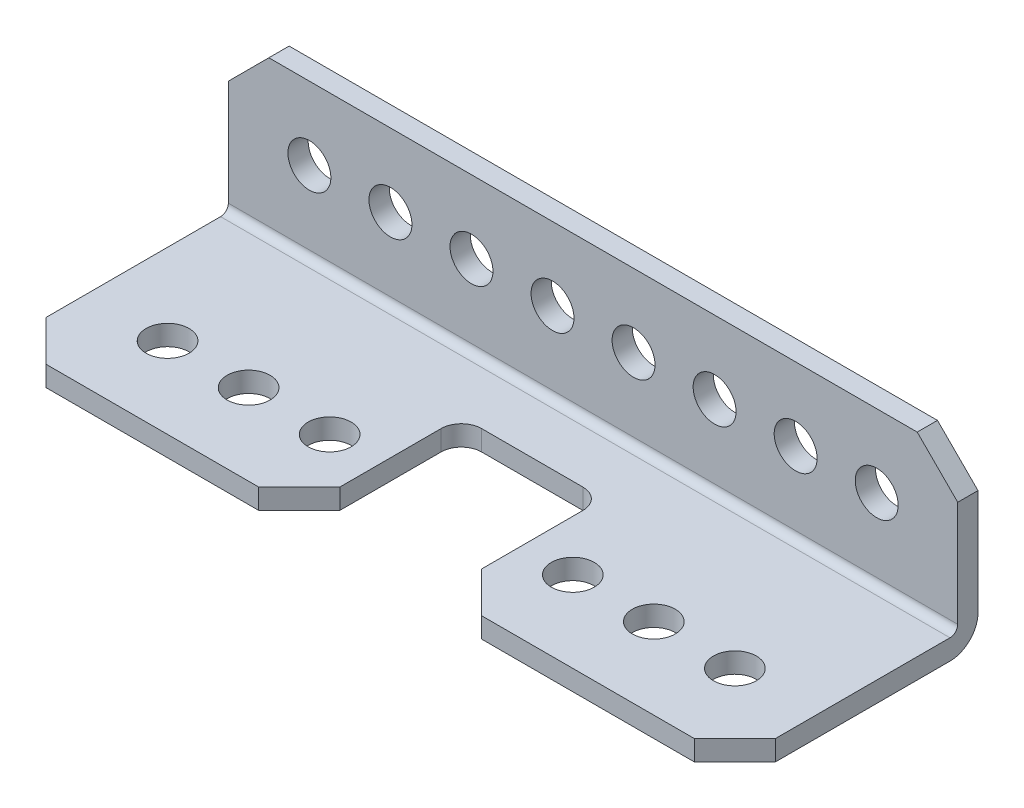
ISO-10303-21;
HEADER;
FILE_DESCRIPTION(('STEP AP214'),'2;1');
FILE_NAME('part.step','',(''),(''),'','','');
FILE_SCHEMA(('AUTOMOTIVE_DESIGN { 1 0 10303 214 1 1 1 1 }'));
ENDSEC;
DATA;
#1=APPLICATION_CONTEXT('core data for automotive mechanical design processes');
#2=APPLICATION_PROTOCOL_DEFINITION('international standard','automotive_design',2000,#1);
#3=PRODUCT_CONTEXT('',#1,'mechanical');
#4=PRODUCT('Part','Part','',(#3));
#5=PRODUCT_RELATED_PRODUCT_CATEGORY('part','',(#4));
#6=PRODUCT_DEFINITION_FORMATION('','',#4);
#7=PRODUCT_DEFINITION_CONTEXT('part definition',#1,'design');
#8=PRODUCT_DEFINITION('design','',#6,#7);
#9=PRODUCT_DEFINITION_SHAPE('','',#8);
#10=(LENGTH_UNIT() NAMED_UNIT(*) SI_UNIT(.MILLI.,.METRE.));
#11=(NAMED_UNIT(*) PLANE_ANGLE_UNIT() SI_UNIT($,.RADIAN.));
#12=(NAMED_UNIT(*) SI_UNIT($,.STERADIAN.) SOLID_ANGLE_UNIT());
#13=UNCERTAINTY_MEASURE_WITH_UNIT(LENGTH_MEASURE(1.E-05),#10,'distance_accuracy_value','');
#14=(GEOMETRIC_REPRESENTATION_CONTEXT(3) GLOBAL_UNCERTAINTY_ASSIGNED_CONTEXT((#13)) GLOBAL_UNIT_ASSIGNED_CONTEXT((#10,
#11,#12)) REPRESENTATION_CONTEXT('',''));
#15=CARTESIAN_POINT('',(0.,0.,0.));
#16=DIRECTION('',(0.,0.,1.));
#17=DIRECTION('',(1.,0.,0.));
#18=AXIS2_PLACEMENT_3D('',#15,#16,#17);
#19=CARTESIAN_POINT('',(-57.15,-12.065,0.));
#20=DIRECTION('',(0.,0.,1.));
#21=DIRECTION('',(1.,0.,0.));
#22=AXIS2_PLACEMENT_3D('',#19,#20,#21);
#23=PLANE('',#22);
#24=CARTESIAN_POINT('',(-44.45,0.635,0.));
#25=DIRECTION('',(0.,0.,1.));
#26=DIRECTION('',(1.,0.,0.));
#27=AXIS2_PLACEMENT_3D('',#24,#25,#26);
#28=CIRCLE('',#27,3.3655);
#29=CARTESIAN_POINT('',(-41.0845,0.635,0.));
#30=VERTEX_POINT('',#29);
#31=EDGE_CURVE('E183',#30,#30,#28,.T.);
#32=ORIENTED_EDGE('',*,*,#31,.T.);
#33=EDGE_LOOP('',(#32));
#34=FACE_BOUND('',#33,.T.);
#35=CARTESIAN_POINT('',(-31.75,0.635,0.));
#36=DIRECTION('',(0.,0.,1.));
#37=DIRECTION('',(1.,0.,0.));
#38=AXIS2_PLACEMENT_3D('',#35,#36,#37);
#39=CIRCLE('',#38,3.3655);
#40=CARTESIAN_POINT('',(-28.3845,0.635,0.));
#41=VERTEX_POINT('',#40);
#42=EDGE_CURVE('E187',#41,#41,#39,.T.);
#43=ORIENTED_EDGE('',*,*,#42,.T.);
#44=EDGE_LOOP('',(#43));
#45=FACE_BOUND('',#44,.T.);
#46=CARTESIAN_POINT('',(-19.05,0.635,0.));
#47=DIRECTION('',(0.,0.,1.));
#48=DIRECTION('',(1.,0.,0.));
#49=AXIS2_PLACEMENT_3D('',#46,#47,#48);
#50=CIRCLE('',#49,3.3655);
#51=CARTESIAN_POINT('',(-15.6845,0.635,0.));
#52=VERTEX_POINT('',#51);
#53=EDGE_CURVE('E190',#52,#52,#50,.T.);
#54=ORIENTED_EDGE('',*,*,#53,.T.);
#55=EDGE_LOOP('',(#54));
#56=FACE_BOUND('',#55,.T.);
#57=CARTESIAN_POINT('',(-6.35,0.635,0.));
#58=DIRECTION('',(0.,0.,1.));
#59=DIRECTION('',(1.,0.,0.));
#60=AXIS2_PLACEMENT_3D('',#57,#58,#59);
#61=CIRCLE('',#60,3.3655);
#62=CARTESIAN_POINT('',(-2.9845,0.635,0.));
#63=VERTEX_POINT('',#62);
#64=EDGE_CURVE('E193',#63,#63,#61,.T.);
#65=ORIENTED_EDGE('',*,*,#64,.T.);
#66=EDGE_LOOP('',(#65));
#67=FACE_BOUND('',#66,.T.);
#68=CARTESIAN_POINT('',(6.35,0.635,0.));
#69=DIRECTION('',(0.,0.,1.));
#70=DIRECTION('',(1.,0.,0.));
#71=AXIS2_PLACEMENT_3D('',#68,#69,#70);
#72=CIRCLE('',#71,3.3655);
#73=CARTESIAN_POINT('',(9.7155,0.635,0.));
#74=VERTEX_POINT('',#73);
#75=EDGE_CURVE('E196',#74,#74,#72,.T.);
#76=ORIENTED_EDGE('',*,*,#75,.T.);
#77=EDGE_LOOP('',(#76));
#78=FACE_BOUND('',#77,.T.);
#79=CARTESIAN_POINT('',(19.05,0.635,0.));
#80=DIRECTION('',(0.,0.,1.));
#81=DIRECTION('',(1.,0.,0.));
#82=AXIS2_PLACEMENT_3D('',#79,#80,#81);
#83=CIRCLE('',#82,3.3655);
#84=CARTESIAN_POINT('',(22.4155,0.635,0.));
#85=VERTEX_POINT('',#84);
#86=EDGE_CURVE('E199',#85,#85,#83,.T.);
#87=ORIENTED_EDGE('',*,*,#86,.T.);
#88=EDGE_LOOP('',(#87));
#89=FACE_BOUND('',#88,.T.);
#90=CARTESIAN_POINT('',(31.75,0.635,0.));
#91=DIRECTION('',(0.,0.,1.));
#92=DIRECTION('',(1.,0.,0.));
#93=AXIS2_PLACEMENT_3D('',#90,#91,#92);
#94=CIRCLE('',#93,3.3655);
#95=CARTESIAN_POINT('',(35.1155,0.635,0.));
#96=VERTEX_POINT('',#95);
#97=EDGE_CURVE('E201',#96,#96,#94,.T.);
#98=ORIENTED_EDGE('',*,*,#97,.T.);
#99=EDGE_LOOP('',(#98));
#100=FACE_BOUND('',#99,.T.);
#101=CARTESIAN_POINT('',(44.45,0.635,0.));
#102=DIRECTION('',(0.,0.,1.));
#103=DIRECTION('',(1.,0.,0.));
#104=AXIS2_PLACEMENT_3D('',#101,#102,#103);
#105=CIRCLE('',#104,3.3655);
#106=CARTESIAN_POINT('',(47.8155,0.635,0.));
#107=VERTEX_POINT('',#106);
#108=EDGE_CURVE('E20',#107,#107,#105,.T.);
#109=ORIENTED_EDGE('',*,*,#108,.T.);
#110=EDGE_LOOP('',(#109));
#111=FACE_BOUND('',#110,.T.);
#112=DIRECTION('',(0.707106781186548,-0.707106781186548,0.));
#113=VECTOR('',#112,1.);
#114=CARTESIAN_POINT('',(50.8,12.065,0.));
#115=LINE('',#114,#113);
#116=CARTESIAN_POINT('',(50.7999999994167,12.0650000001167,0.));
#117=VERTEX_POINT('',#116);
#118=CARTESIAN_POINT('',(57.1499999998767,5.71500000024666,-2.48354722204303E-10));
#119=VERTEX_POINT('',#118);
#120=EDGE_CURVE('E155',#117,#119,#115,.T.);
#121=ORIENTED_EDGE('',*,*,#120,.T.);
#122=DIRECTION('',(0.,1.,0.));
#123=VECTOR('',#122,1.);
#124=CARTESIAN_POINT('',(57.15,12.065,-7.45058095080742E-10));
#125=LINE('',#124,#123);
#126=CARTESIAN_POINT('',(57.15,-10.84580000035,-3.72528939120154E-10));
#127=VERTEX_POINT('',#126);
#128=EDGE_CURVE('E150',#119,#127,#125,.F.);
#129=ORIENTED_EDGE('',*,*,#128,.T.);
#130=DIRECTION('',(1.,0.,0.));
#131=VECTOR('',#130,1.);
#132=CARTESIAN_POINT('',(57.15,-10.8458,0.));
#133=LINE('',#132,#131);
#134=CARTESIAN_POINT('',(-57.15,-10.84580000035,-3.72528939120154E-10));
#135=VERTEX_POINT('',#134);
#136=EDGE_CURVE('E152',#135,#127,#133,.T.);
#137=ORIENTED_EDGE('',*,*,#136,.F.);
#138=DIRECTION('',(0.,1.,0.));
#139=VECTOR('',#138,1.);
#140=CARTESIAN_POINT('',(-57.15,12.065,-7.45058095080742E-10));
#141=LINE('',#140,#139);
#142=CARTESIAN_POINT('',(-57.1499999999383,5.71500000030833,-7.450586733219E-10));
#143=VERTEX_POINT('',#142);
#144=EDGE_CURVE('E186',#135,#143,#141,.T.);
#145=ORIENTED_EDGE('',*,*,#144,.T.);
#146=DIRECTION('',(0.707106781186548,0.707106781186548,0.));
#147=VECTOR('',#146,1.);
#148=CARTESIAN_POINT('',(-57.15,5.715,-7.45059829804218E-10));
#149=LINE('',#148,#147);
#150=CARTESIAN_POINT('',(-50.7999999998,12.0650000001333,-4.9670742056455E-10));
#151=VERTEX_POINT('',#150);
#152=EDGE_CURVE('E209',#143,#151,#149,.T.);
#153=ORIENTED_EDGE('',*,*,#152,.T.);
#154=DIRECTION('',(1.,0.,0.));
#155=VECTOR('',#154,1.);
#156=CARTESIAN_POINT('',(-57.15,12.065,0.));
#157=LINE('',#156,#155);
#158=EDGE_CURVE('E231',#151,#117,#157,.T.);
#159=ORIENTED_EDGE('',*,*,#158,.T.);
#160=EDGE_LOOP('',(#121,#129,#137,#145,#153,#159));
#161=FACE_BOUND('',#160,.T.);
#162=ADVANCED_FACE('F17',(#34,#45,#56,#67,#78,#89,#100,#111,#161),#23,.F.);
#163=CARTESIAN_POINT('',(50.8,12.065,3.175));
#164=DIRECTION('',(-0.707106781186548,-0.707106781186548,0.));
#165=DIRECTION('',(0.707106781186548,-0.707106781186548,0.));
#166=AXIS2_PLACEMENT_3D('',#163,#164,#165);
#167=PLANE('',#166);
#168=DIRECTION('',(0.,0.,1.));
#169=VECTOR('',#168,1.);
#170=CARTESIAN_POINT('',(57.149999999815,5.715000000185,3.175));
#171=LINE('',#170,#169);
#172=CARTESIAN_POINT('',(57.1499999999383,5.71500000030834,3.175));
#173=VERTEX_POINT('',#172);
#174=EDGE_CURVE('E238',#119,#173,#171,.T.);
#175=ORIENTED_EDGE('',*,*,#174,.F.);
#176=ORIENTED_EDGE('',*,*,#120,.F.);
#177=DIRECTION('',(0.,0.,-1.));
#178=VECTOR('',#177,1.);
#179=CARTESIAN_POINT('',(50.7999999993,12.065,3.175));
#180=LINE('',#179,#178);
#181=CARTESIAN_POINT('',(50.7999999993,12.0650000005333,3.175));
#182=VERTEX_POINT('',#181);
#183=EDGE_CURVE('E216',#117,#182,#180,.F.);
#184=ORIENTED_EDGE('',*,*,#183,.T.);
#185=DIRECTION('',(-0.707106781201581,0.707106781171514,0.));
#186=VECTOR('',#185,1.);
#187=CARTESIAN_POINT('',(57.15,5.71500000037,3.175));
#188=LINE('',#187,#186);
#189=EDGE_CURVE('E177',#173,#182,#188,.T.);
#190=ORIENTED_EDGE('',*,*,#189,.F.);
#191=EDGE_LOOP('',(#175,#176,#184,#190));
#192=FACE_BOUND('',#191,.T.);
#193=ADVANCED_FACE('F409',(#192),#167,.F.);
#194=CARTESIAN_POINT('',(-57.15,12.065,3.175));
#195=DIRECTION('',(0.,-1.,0.));
#196=DIRECTION('',(0.,0.,-1.));
#197=AXIS2_PLACEMENT_3D('',#194,#195,#196);
#198=PLANE('',#197);
#199=ORIENTED_EDGE('',*,*,#183,.F.);
#200=ORIENTED_EDGE('',*,*,#158,.F.);
#201=DIRECTION('',(0.,0.,1.));
#202=VECTOR('',#201,1.);
#203=CARTESIAN_POINT('',(-50.7999999998,12.0650000002,3.175));
#204=LINE('',#203,#202);
#205=CARTESIAN_POINT('',(-50.8000000002,12.0650000006,3.175));
#206=VERTEX_POINT('',#205);
#207=EDGE_CURVE('E206',#151,#206,#204,.T.);
#208=ORIENTED_EDGE('',*,*,#207,.T.);
#209=DIRECTION('',(1.,0.,0.));
#210=VECTOR('',#209,1.);
#211=CARTESIAN_POINT('',(-57.15,12.0650000008,3.175));
#212=LINE('',#211,#210);
#213=EDGE_CURVE('E224',#182,#206,#212,.F.);
#214=ORIENTED_EDGE('',*,*,#213,.F.);
#215=EDGE_LOOP('',(#199,#200,#208,#214));
#216=FACE_BOUND('',#215,.T.);
#217=ADVANCED_FACE('F407',(#216),#198,.F.);
#218=CARTESIAN_POINT('',(-57.15,5.715,3.175));
#219=DIRECTION('',(0.707106781186548,-0.707106781186548,0.));
#220=DIRECTION('',(0.707106781186548,0.707106781186548,0.));
#221=AXIS2_PLACEMENT_3D('',#218,#219,#220);
#222=PLANE('',#221);
#223=ORIENTED_EDGE('',*,*,#207,.F.);
#224=ORIENTED_EDGE('',*,*,#152,.F.);
#225=DIRECTION('',(0.,0.,-1.));
#226=VECTOR('',#225,1.);
#227=CARTESIAN_POINT('',(-57.15,5.71500000037,3.175));
#228=LINE('',#227,#226);
#229=CARTESIAN_POINT('',(-57.15,5.71500000037,3.175));
#230=VERTEX_POINT('',#229);
#231=EDGE_CURVE('E168',#143,#230,#228,.F.);
#232=ORIENTED_EDGE('',*,*,#231,.T.);
#233=DIRECTION('',(-0.707106781140335,-0.70710678123276,0.));
#234=VECTOR('',#233,1.);
#235=CARTESIAN_POINT('',(-50.8000000004,12.0650000008,3.175));
#236=LINE('',#235,#234);
#237=EDGE_CURVE('E227',#206,#230,#236,.T.);
#238=ORIENTED_EDGE('',*,*,#237,.F.);
#239=EDGE_LOOP('',(#223,#224,#232,#238));
#240=FACE_BOUND('',#239,.T.);
#241=ADVANCED_FACE('F402',(#240),#222,.F.);
#242=CARTESIAN_POINT('',(44.45,0.635,0.));
#243=DIRECTION('',(0.,0.,1.));
#244=DIRECTION('',(1.,0.,0.));
#245=AXIS2_PLACEMENT_3D('',#242,#243,#244);
#246=CYLINDRICAL_SURFACE('',#245,3.3655);
#247=CARTESIAN_POINT('',(44.45,0.635,3.17500000075));
#248=DIRECTION('',(0.,0.,1.));
#249=DIRECTION('',(1.,0.,0.));
#250=AXIS2_PLACEMENT_3D('',#247,#248,#249);
#251=CIRCLE('',#250,3.3655);
#252=CARTESIAN_POINT('',(47.8155,0.635,3.17500000075));
#253=VERTEX_POINT('',#252);
#254=EDGE_CURVE('E181',#253,#253,#251,.F.);
#255=ORIENTED_EDGE('',*,*,#254,.F.);
#256=EDGE_LOOP('',(#255));
#257=FACE_BOUND('',#256,.T.);
#258=ORIENTED_EDGE('',*,*,#108,.F.);
#259=EDGE_LOOP('',(#258));
#260=FACE_BOUND('',#259,.T.);
#261=ADVANCED_FACE('F788',(#257,#260),#246,.F.);
#262=CARTESIAN_POINT('',(31.75,0.635,0.));
#263=DIRECTION('',(0.,0.,1.));
#264=DIRECTION('',(1.,0.,0.));
#265=AXIS2_PLACEMENT_3D('',#262,#263,#264);
#266=CYLINDRICAL_SURFACE('',#265,3.3655);
#267=CARTESIAN_POINT('',(31.75,0.635,3.17500000075));
#268=DIRECTION('',(0.,0.,1.));
#269=DIRECTION('',(1.,0.,0.));
#270=AXIS2_PLACEMENT_3D('',#267,#268,#269);
#271=CIRCLE('',#270,3.3655);
#272=CARTESIAN_POINT('',(35.1155,0.635,3.17500000075));
#273=VERTEX_POINT('',#272);
#274=EDGE_CURVE('E329',#273,#273,#271,.F.);
#275=ORIENTED_EDGE('',*,*,#274,.F.);
#276=EDGE_LOOP('',(#275));
#277=FACE_BOUND('',#276,.T.);
#278=ORIENTED_EDGE('',*,*,#97,.F.);
#279=EDGE_LOOP('',(#278));
#280=FACE_BOUND('',#279,.T.);
#281=ADVANCED_FACE('F779',(#277,#280),#266,.F.);
#282=CARTESIAN_POINT('',(19.05,0.635,0.));
#283=DIRECTION('',(0.,0.,1.));
#284=DIRECTION('',(1.,0.,0.));
#285=AXIS2_PLACEMENT_3D('',#282,#283,#284);
#286=CYLINDRICAL_SURFACE('',#285,3.3655);
#287=CARTESIAN_POINT('',(19.05,0.635,3.17500000075));
#288=DIRECTION('',(0.,0.,1.));
#289=DIRECTION('',(1.,0.,0.));
#290=AXIS2_PLACEMENT_3D('',#287,#288,#289);
#291=CIRCLE('',#290,3.3655);
#292=CARTESIAN_POINT('',(22.4155,0.635,3.17500000075));
#293=VERTEX_POINT('',#292);
#294=EDGE_CURVE('E327',#293,#293,#291,.F.);
#295=ORIENTED_EDGE('',*,*,#294,.F.);
#296=EDGE_LOOP('',(#295));
#297=FACE_BOUND('',#296,.T.);
#298=ORIENTED_EDGE('',*,*,#86,.F.);
#299=EDGE_LOOP('',(#298));
#300=FACE_BOUND('',#299,.T.);
#301=ADVANCED_FACE('F770',(#297,#300),#286,.F.);
#302=CARTESIAN_POINT('',(6.35,0.635,0.));
#303=DIRECTION('',(0.,0.,1.));
#304=DIRECTION('',(1.,0.,0.));
#305=AXIS2_PLACEMENT_3D('',#302,#303,#304);
#306=CYLINDRICAL_SURFACE('',#305,3.3655);
#307=CARTESIAN_POINT('',(6.35,0.635,3.17500000075));
#308=DIRECTION('',(0.,0.,1.));
#309=DIRECTION('',(1.,0.,0.));
#310=AXIS2_PLACEMENT_3D('',#307,#308,#309);
#311=CIRCLE('',#310,3.3655);
#312=CARTESIAN_POINT('',(9.7155,0.635,3.17500000075));
#313=VERTEX_POINT('',#312);
#314=EDGE_CURVE('E324',#313,#313,#311,.F.);
#315=ORIENTED_EDGE('',*,*,#314,.F.);
#316=EDGE_LOOP('',(#315));
#317=FACE_BOUND('',#316,.T.);
#318=ORIENTED_EDGE('',*,*,#75,.F.);
#319=EDGE_LOOP('',(#318));
#320=FACE_BOUND('',#319,.T.);
#321=ADVANCED_FACE('F761',(#317,#320),#306,.F.);
#322=CARTESIAN_POINT('',(-6.35,0.635,0.));
#323=DIRECTION('',(0.,0.,1.));
#324=DIRECTION('',(1.,0.,0.));
#325=AXIS2_PLACEMENT_3D('',#322,#323,#324);
#326=CYLINDRICAL_SURFACE('',#325,3.3655);
#327=CARTESIAN_POINT('',(-6.35,0.635,3.17500000075));
#328=DIRECTION('',(0.,0.,1.));
#329=DIRECTION('',(1.,0.,0.));
#330=AXIS2_PLACEMENT_3D('',#327,#328,#329);
#331=CIRCLE('',#330,3.3655);
#332=CARTESIAN_POINT('',(-2.9845,0.635,3.17500000075));
#333=VERTEX_POINT('',#332);
#334=EDGE_CURVE('E321',#333,#333,#331,.F.);
#335=ORIENTED_EDGE('',*,*,#334,.F.);
#336=EDGE_LOOP('',(#335));
#337=FACE_BOUND('',#336,.T.);
#338=ORIENTED_EDGE('',*,*,#64,.F.);
#339=EDGE_LOOP('',(#338));
#340=FACE_BOUND('',#339,.T.);
#341=ADVANCED_FACE('F752',(#337,#340),#326,.F.);
#342=CARTESIAN_POINT('',(-19.05,0.635,0.));
#343=DIRECTION('',(0.,0.,1.));
#344=DIRECTION('',(1.,0.,0.));
#345=AXIS2_PLACEMENT_3D('',#342,#343,#344);
#346=CYLINDRICAL_SURFACE('',#345,3.3655);
#347=CARTESIAN_POINT('',(-19.05,0.635,3.17500000075));
#348=DIRECTION('',(0.,0.,1.));
#349=DIRECTION('',(1.,0.,0.));
#350=AXIS2_PLACEMENT_3D('',#347,#348,#349);
#351=CIRCLE('',#350,3.3655);
#352=CARTESIAN_POINT('',(-15.6845,0.635,3.17500000075));
#353=VERTEX_POINT('',#352);
#354=EDGE_CURVE('E318',#353,#353,#351,.F.);
#355=ORIENTED_EDGE('',*,*,#354,.F.);
#356=EDGE_LOOP('',(#355));
#357=FACE_BOUND('',#356,.T.);
#358=ORIENTED_EDGE('',*,*,#53,.F.);
#359=EDGE_LOOP('',(#358));
#360=FACE_BOUND('',#359,.T.);
#361=ADVANCED_FACE('F743',(#357,#360),#346,.F.);
#362=CARTESIAN_POINT('',(-31.75,0.635,0.));
#363=DIRECTION('',(0.,0.,1.));
#364=DIRECTION('',(1.,0.,0.));
#365=AXIS2_PLACEMENT_3D('',#362,#363,#364);
#366=CYLINDRICAL_SURFACE('',#365,3.3655);
#367=CARTESIAN_POINT('',(-31.75,0.635,3.17500000075));
#368=DIRECTION('',(0.,0.,1.));
#369=DIRECTION('',(1.,0.,0.));
#370=AXIS2_PLACEMENT_3D('',#367,#368,#369);
#371=CIRCLE('',#370,3.3655);
#372=CARTESIAN_POINT('',(-28.3845,0.635,3.17500000075));
#373=VERTEX_POINT('',#372);
#374=EDGE_CURVE('E315',#373,#373,#371,.F.);
#375=ORIENTED_EDGE('',*,*,#374,.F.);
#376=EDGE_LOOP('',(#375));
#377=FACE_BOUND('',#376,.T.);
#378=ORIENTED_EDGE('',*,*,#42,.F.);
#379=EDGE_LOOP('',(#378));
#380=FACE_BOUND('',#379,.T.);
#381=ADVANCED_FACE('F734',(#377,#380),#366,.F.);
#382=CARTESIAN_POINT('',(-44.45,0.635,0.));
#383=DIRECTION('',(0.,0.,1.));
#384=DIRECTION('',(1.,0.,0.));
#385=AXIS2_PLACEMENT_3D('',#382,#383,#384);
#386=CYLINDRICAL_SURFACE('',#385,3.3655);
#387=CARTESIAN_POINT('',(-44.45,0.635,3.17500000075));
#388=DIRECTION('',(0.,0.,1.));
#389=DIRECTION('',(1.,0.,0.));
#390=AXIS2_PLACEMENT_3D('',#387,#388,#389);
#391=CIRCLE('',#390,3.3655);
#392=CARTESIAN_POINT('',(-41.0845,0.635,3.17500000075));
#393=VERTEX_POINT('',#392);
#394=EDGE_CURVE('E312',#393,#393,#391,.F.);
#395=ORIENTED_EDGE('',*,*,#394,.F.);
#396=EDGE_LOOP('',(#395));
#397=FACE_BOUND('',#396,.T.);
#398=ORIENTED_EDGE('',*,*,#31,.F.);
#399=EDGE_LOOP('',(#398));
#400=FACE_BOUND('',#399,.T.);
#401=ADVANCED_FACE('F726',(#397,#400),#386,.F.);
#402=CARTESIAN_POINT('',(57.15,-10.8458,4.3942));
#403=DIRECTION('',(1.,0.,0.));
#404=DIRECTION('',(0.,0.,-1.));
#405=AXIS2_PLACEMENT_3D('',#402,#403,#404);
#406=CYLINDRICAL_SURFACE('',#405,4.3942);
#407=DIRECTION('',(1.,0.,0.));
#408=VECTOR('',#407,1.);
#409=CARTESIAN_POINT('',(-57.15,-15.2399999999999,4.3942));
#410=LINE('',#409,#408);
#411=CARTESIAN_POINT('',(57.15,-15.2399999999999,4.3942));
#412=VERTEX_POINT('',#411);
#413=CARTESIAN_POINT('',(-57.15,-15.2399999999999,4.3942));
#414=VERTEX_POINT('',#413);
#415=EDGE_CURVE('E311',#412,#414,#410,.F.);
#416=ORIENTED_EDGE('',*,*,#415,.T.);
#417=CARTESIAN_POINT('',(-57.15,-10.8458,4.3942));
#418=DIRECTION('',(1.,0.,0.));
#419=DIRECTION('',(0.,0.,-1.));
#420=AXIS2_PLACEMENT_3D('',#417,#418,#419);
#421=CIRCLE('',#420,4.3942);
#422=EDGE_CURVE('E167',#135,#414,#421,.F.);
#423=ORIENTED_EDGE('',*,*,#422,.F.);
#424=ORIENTED_EDGE('',*,*,#136,.T.);
#425=CARTESIAN_POINT('',(57.15,-10.8458,4.3942));
#426=DIRECTION('',(1.,0.,0.));
#427=DIRECTION('',(0.,0.,-1.));
#428=AXIS2_PLACEMENT_3D('',#425,#426,#427);
#429=CIRCLE('',#428,4.3942);
#430=EDGE_CURVE('E164',#127,#412,#429,.F.);
#431=ORIENTED_EDGE('',*,*,#430,.T.);
#432=EDGE_LOOP('',(#416,#423,#424,#431));
#433=FACE_BOUND('',#432,.T.);
#434=ADVANCED_FACE('F163',(#433),#406,.T.);
#435=CARTESIAN_POINT('',(-57.15,-12.065,3.175));
#436=DIRECTION('',(0.,0.,1.));
#437=DIRECTION('',(1.,0.,0.));
#438=AXIS2_PLACEMENT_3D('',#435,#436,#437);
#439=PLANE('',#438);
#440=ORIENTED_EDGE('',*,*,#394,.T.);
#441=EDGE_LOOP('',(#440));
#442=FACE_BOUND('',#441,.T.);
#443=ORIENTED_EDGE('',*,*,#374,.T.);
#444=EDGE_LOOP('',(#443));
#445=FACE_BOUND('',#444,.T.);
#446=ORIENTED_EDGE('',*,*,#354,.T.);
#447=EDGE_LOOP('',(#446));
#448=FACE_BOUND('',#447,.T.);
#449=ORIENTED_EDGE('',*,*,#334,.T.);
#450=EDGE_LOOP('',(#449));
#451=FACE_BOUND('',#450,.T.);
#452=ORIENTED_EDGE('',*,*,#314,.T.);
#453=EDGE_LOOP('',(#452));
#454=FACE_BOUND('',#453,.T.);
#455=ORIENTED_EDGE('',*,*,#294,.T.);
#456=EDGE_LOOP('',(#455));
#457=FACE_BOUND('',#456,.T.);
#458=ORIENTED_EDGE('',*,*,#274,.T.);
#459=EDGE_LOOP('',(#458));
#460=FACE_BOUND('',#459,.T.);
#461=ORIENTED_EDGE('',*,*,#254,.T.);
#462=EDGE_LOOP('',(#461));
#463=FACE_BOUND('',#462,.T.);
#464=DIRECTION('',(0.,1.,0.));
#465=VECTOR('',#464,1.);
#466=CARTESIAN_POINT('',(-57.15,-12.065,3.175));
#467=LINE('',#466,#465);
#468=CARTESIAN_POINT('',(-57.15,-10.84580000035,3.175));
#469=VERTEX_POINT('',#468);
#470=EDGE_CURVE('E334',#230,#469,#467,.F.);
#471=ORIENTED_EDGE('',*,*,#470,.T.);
#472=DIRECTION('',(1.,0.,0.));
#473=VECTOR('',#472,1.);
#474=CARTESIAN_POINT('',(57.15,-10.8458,3.175));
#475=LINE('',#474,#473);
#476=CARTESIAN_POINT('',(57.15,-10.84580000035,3.175));
#477=VERTEX_POINT('',#476);
#478=EDGE_CURVE('E298',#469,#477,#475,.T.);
#479=ORIENTED_EDGE('',*,*,#478,.T.);
#480=DIRECTION('',(0.,1.,0.));
#481=VECTOR('',#480,1.);
#482=CARTESIAN_POINT('',(57.15,-12.065,3.175));
#483=LINE('',#482,#481);
#484=EDGE_CURVE('E174',#477,#173,#483,.T.);
#485=ORIENTED_EDGE('',*,*,#484,.T.);
#486=ORIENTED_EDGE('',*,*,#189,.T.);
#487=ORIENTED_EDGE('',*,*,#213,.T.);
#488=ORIENTED_EDGE('',*,*,#237,.T.);
#489=EDGE_LOOP('',(#471,#479,#485,#486,#487,#488));
#490=FACE_BOUND('',#489,.T.);
#491=ADVANCED_FACE('F404',(#442,#445,#448,#451,#454,#457,#460,#463,#490),#439,.T.);
#492=CARTESIAN_POINT('',(-57.15,-15.24,38.1));
#493=DIRECTION('',(0.,1.,0.));
#494=DIRECTION('',(0.,0.,1.));
#495=AXIS2_PLACEMENT_3D('',#492,#493,#494);
#496=PLANE('',#495);
#497=CARTESIAN_POINT('',(-44.45,-15.24,25.4));
#498=DIRECTION('',(0.,1.,0.));
#499=DIRECTION('',(0.,0.,1.));
#500=AXIS2_PLACEMENT_3D('',#497,#498,#499);
#501=CIRCLE('',#500,3.3655);
#502=CARTESIAN_POINT('',(-44.45,-15.24,28.7655));
#503=VERTEX_POINT('',#502);
#504=EDGE_CURVE('E276',#503,#503,#501,.T.);
#505=ORIENTED_EDGE('',*,*,#504,.T.);
#506=EDGE_LOOP('',(#505));
#507=FACE_BOUND('',#506,.T.);
#508=CARTESIAN_POINT('',(-31.75,-15.24,25.4));
#509=DIRECTION('',(0.,1.,0.));
#510=DIRECTION('',(0.,0.,1.));
#511=AXIS2_PLACEMENT_3D('',#508,#509,#510);
#512=CIRCLE('',#511,3.3655);
#513=CARTESIAN_POINT('',(-31.75,-15.24,28.7655));
#514=VERTEX_POINT('',#513);
#515=EDGE_CURVE('E280',#514,#514,#512,.T.);
#516=ORIENTED_EDGE('',*,*,#515,.T.);
#517=EDGE_LOOP('',(#516));
#518=FACE_BOUND('',#517,.T.);
#519=CARTESIAN_POINT('',(-19.05,-15.24,25.4));
#520=DIRECTION('',(0.,1.,0.));
#521=DIRECTION('',(0.,0.,1.));
#522=AXIS2_PLACEMENT_3D('',#519,#520,#521);
#523=CIRCLE('',#522,3.3655);
#524=CARTESIAN_POINT('',(-19.05,-15.24,28.7655));
#525=VERTEX_POINT('',#524);
#526=EDGE_CURVE('E283',#525,#525,#523,.T.);
#527=ORIENTED_EDGE('',*,*,#526,.T.);
#528=EDGE_LOOP('',(#527));
#529=FACE_BOUND('',#528,.T.);
#530=CARTESIAN_POINT('',(19.05,-15.24,25.4));
#531=DIRECTION('',(0.,1.,0.));
#532=DIRECTION('',(0.,0.,1.));
#533=AXIS2_PLACEMENT_3D('',#530,#531,#532);
#534=CIRCLE('',#533,3.3655);
#535=CARTESIAN_POINT('',(19.05,-15.24,28.7655));
#536=VERTEX_POINT('',#535);
#537=EDGE_CURVE('E286',#536,#536,#534,.T.);
#538=ORIENTED_EDGE('',*,*,#537,.T.);
#539=EDGE_LOOP('',(#538));
#540=FACE_BOUND('',#539,.T.);
#541=CARTESIAN_POINT('',(31.75,-15.24,25.4));
#542=DIRECTION('',(0.,1.,0.));
#543=DIRECTION('',(0.,0.,1.));
#544=AXIS2_PLACEMENT_3D('',#541,#542,#543);
#545=CIRCLE('',#544,3.3655);
#546=CARTESIAN_POINT('',(31.75,-15.24,28.7655));
#547=VERTEX_POINT('',#546);
#548=EDGE_CURVE('E289',#547,#547,#545,.T.);
#549=ORIENTED_EDGE('',*,*,#548,.T.);
#550=EDGE_LOOP('',(#549));
#551=FACE_BOUND('',#550,.T.);
#552=CARTESIAN_POINT('',(44.45,-15.24,25.4));
#553=DIRECTION('',(0.,1.,0.));
#554=DIRECTION('',(0.,0.,1.));
#555=AXIS2_PLACEMENT_3D('',#552,#553,#554);
#556=CIRCLE('',#555,3.3655);
#557=CARTESIAN_POINT('',(44.45,-15.24,28.7655));
#558=VERTEX_POINT('',#557);
#559=EDGE_CURVE('E292',#558,#558,#556,.T.);
#560=ORIENTED_EDGE('',*,*,#559,.T.);
#561=EDGE_LOOP('',(#560));
#562=FACE_BOUND('',#561,.T.);
#563=DIRECTION('',(-0.707106781186548,0.,0.707106781186548));
#564=VECTOR('',#563,1.);
#565=CARTESIAN_POINT('',(-17.4625,-15.24,38.1));
#566=LINE('',#565,#564);
#567=CARTESIAN_POINT('',(-11.1125000001333,-15.24,31.7500000004));
#568=VERTEX_POINT('',#567);
#569=CARTESIAN_POINT('',(-17.4625,-15.24,38.1));
#570=VERTEX_POINT('',#569);
#571=EDGE_CURVE('E388',#568,#570,#566,.T.);
#572=ORIENTED_EDGE('',*,*,#571,.T.);
#573=DIRECTION('',(1.,0.,0.));
#574=VECTOR('',#573,1.);
#575=CARTESIAN_POINT('',(-57.15,-15.24,38.1));
#576=LINE('',#575,#574);
#577=CARTESIAN_POINT('',(-50.8000000002,-15.24,38.0999999998667));
#578=VERTEX_POINT('',#577);
#579=EDGE_CURVE('E454',#570,#578,#576,.F.);
#580=ORIENTED_EDGE('',*,*,#579,.T.);
#581=DIRECTION('',(-0.707106781186548,0.,-0.707106781186548));
#582=VECTOR('',#581,1.);
#583=CARTESIAN_POINT('',(-57.15,-15.24,31.75));
#584=LINE('',#583,#582);
#585=CARTESIAN_POINT('',(-57.1500000000875,-15.24,31.7499999993875));
#586=VERTEX_POINT('',#585);
#587=EDGE_CURVE('E295',#578,#586,#584,.T.);
#588=ORIENTED_EDGE('',*,*,#587,.T.);
#589=DIRECTION('',(0.,0.,-1.));
#590=VECTOR('',#589,1.);
#591=CARTESIAN_POINT('',(-57.15,-15.24,3.175));
#592=LINE('',#591,#590);
#593=EDGE_CURVE('E350',#586,#414,#592,.T.);
#594=ORIENTED_EDGE('',*,*,#593,.T.);
#595=ORIENTED_EDGE('',*,*,#415,.F.);
#596=DIRECTION('',(0.,0.,1.));
#597=VECTOR('',#596,1.);
#598=CARTESIAN_POINT('',(57.15,-15.24,38.1));
#599=LINE('',#598,#597);
#600=CARTESIAN_POINT('',(57.14999999995,-15.24,31.75000000035));
#601=VERTEX_POINT('',#600);
#602=EDGE_CURVE('E173',#412,#601,#599,.T.);
#603=ORIENTED_EDGE('',*,*,#602,.T.);
#604=DIRECTION('',(-0.707106781186548,0.,0.707106781186548));
#605=VECTOR('',#604,1.);
#606=CARTESIAN_POINT('',(50.8,-15.24,38.1));
#607=LINE('',#606,#605);
#608=CARTESIAN_POINT('',(50.7999999993875,-15.24,38.1000000000875));
#609=VERTEX_POINT('',#608);
#610=EDGE_CURVE('E359',#601,#609,#607,.T.);
#611=ORIENTED_EDGE('',*,*,#610,.T.);
#612=DIRECTION('',(1.,0.,0.));
#613=VECTOR('',#612,1.);
#614=CARTESIAN_POINT('',(-57.15,-15.24,38.1));
#615=LINE('',#614,#613);
#616=CARTESIAN_POINT('',(17.46250000035,-15.24,38.10000000035));
#617=VERTEX_POINT('',#616);
#618=EDGE_CURVE('E370',#609,#617,#615,.F.);
#619=ORIENTED_EDGE('',*,*,#618,.T.);
#620=DIRECTION('',(-0.707106781186548,0.,-0.707106781186548));
#621=VECTOR('',#620,1.);
#622=CARTESIAN_POINT('',(17.4625,-15.24,38.1));
#623=LINE('',#622,#621);
#624=CARTESIAN_POINT('',(11.1124999999,-15.24,31.74999999985));
#625=VERTEX_POINT('',#624);
#626=EDGE_CURVE('E365',#617,#625,#623,.T.);
#627=ORIENTED_EDGE('',*,*,#626,.T.);
#628=DIRECTION('',(0.,0.,-1.));
#629=VECTOR('',#628,1.);
#630=CARTESIAN_POINT('',(11.1125,-15.24,38.1));
#631=LINE('',#630,#629);
#632=CARTESIAN_POINT('',(11.1125,-15.24,15.8750000002));
#633=VERTEX_POINT('',#632);
#634=EDGE_CURVE('E360',#625,#633,#631,.T.);
#635=ORIENTED_EDGE('',*,*,#634,.T.);
#636=CARTESIAN_POINT('',(7.9375,-15.24,15.8749999999999));
#637=DIRECTION('',(0.,1.,0.));
#638=DIRECTION('',(0.,0.,1.));
#639=AXIS2_PLACEMENT_3D('',#636,#637,#638);
#640=CIRCLE('',#639,3.175);
#641=CARTESIAN_POINT('',(7.937500000185,-15.24,12.6999999999999));
#642=VERTEX_POINT('',#641);
#643=EDGE_CURVE('E302',#633,#642,#640,.T.);
#644=ORIENTED_EDGE('',*,*,#643,.T.);
#645=DIRECTION('',(1.,0.,0.));
#646=VECTOR('',#645,1.);
#647=CARTESIAN_POINT('',(-11.1125,-15.24,12.6999999999999));
#648=LINE('',#647,#646);
#649=CARTESIAN_POINT('',(-7.937499999815,-15.24,12.6999999999999));
#650=VERTEX_POINT('',#649);
#651=EDGE_CURVE('E305',#642,#650,#648,.F.);
#652=ORIENTED_EDGE('',*,*,#651,.T.);
#653=CARTESIAN_POINT('',(-7.9375,-15.24,15.8749999999999));
#654=DIRECTION('',(0.,1.,0.));
#655=DIRECTION('',(0.,0.,1.));
#656=AXIS2_PLACEMENT_3D('',#653,#654,#655);
#657=CIRCLE('',#656,3.175);
#658=CARTESIAN_POINT('',(-11.1125,-15.24,15.8750000002));
#659=VERTEX_POINT('',#658);
#660=EDGE_CURVE('E306',#650,#659,#657,.T.);
#661=ORIENTED_EDGE('',*,*,#660,.T.);
#662=DIRECTION('',(0.,0.,1.));
#663=VECTOR('',#662,1.);
#664=CARTESIAN_POINT('',(-11.1125,-15.24,38.1));
#665=LINE('',#664,#663);
#666=EDGE_CURVE('E309',#659,#568,#665,.T.);
#667=ORIENTED_EDGE('',*,*,#666,.T.);
#668=EDGE_LOOP('',(#572,#580,#588,#594,#595,#603,#611,#619,#627,#635,#644,#652,#661,#667));
#669=FACE_BOUND('',#668,.T.);
#670=ADVANCED_FACE('F702',(#507,#518,#529,#540,#551,#562,#669),#496,.F.);
#671=CARTESIAN_POINT('',(-57.15,-15.24,38.1));
#672=DIRECTION('',(0.,0.,-1.));
#673=DIRECTION('',(0.,1.,0.));
#674=AXIS2_PLACEMENT_3D('',#671,#672,#673);
#675=PLANE('',#674);
#676=DIRECTION('',(0.,1.,0.));
#677=VECTOR('',#676,1.);
#678=CARTESIAN_POINT('',(-17.4625,-15.24,38.1));
#679=LINE('',#678,#677);
#680=CARTESIAN_POINT('',(-17.4625,-12.065,38.1));
#681=VERTEX_POINT('',#680);
#682=EDGE_CURVE('E391',#570,#681,#679,.T.);
#683=ORIENTED_EDGE('',*,*,#682,.T.);
#684=DIRECTION('',(1.,0.,0.));
#685=VECTOR('',#684,1.);
#686=CARTESIAN_POINT('',(-57.15,-12.065,38.1));
#687=LINE('',#686,#685);
#688=CARTESIAN_POINT('',(-50.8000000002833,-12.065,38.09999999995));
#689=VERTEX_POINT('',#688);
#690=EDGE_CURVE('E279',#689,#681,#687,.T.);
#691=ORIENTED_EDGE('',*,*,#690,.F.);
#692=DIRECTION('',(0.,1.,0.));
#693=VECTOR('',#692,1.);
#694=CARTESIAN_POINT('',(-50.8000000002,-15.24,38.0999999998));
#695=LINE('',#694,#693);
#696=EDGE_CURVE('E461',#689,#578,#695,.F.);
#697=ORIENTED_EDGE('',*,*,#696,.T.);
#698=ORIENTED_EDGE('',*,*,#579,.F.);
#699=EDGE_LOOP('',(#683,#691,#697,#698));
#700=FACE_BOUND('',#699,.T.);
#701=ADVANCED_FACE('F484',(#700),#675,.F.);
#702=CARTESIAN_POINT('',(-17.4625,-15.24,38.1));
#703=DIRECTION('',(-0.707106781186548,0.,-0.707106781186548));
#704=DIRECTION('',(-0.707106781186548,0.,0.707106781186548));
#705=AXIS2_PLACEMENT_3D('',#702,#703,#704);
#706=PLANE('',#705);
#707=DIRECTION('',(0.,1.,0.));
#708=VECTOR('',#707,1.);
#709=CARTESIAN_POINT('',(-11.1125,12.065,31.7500000004));
#710=LINE('',#709,#708);
#711=CARTESIAN_POINT('',(-11.1125000002667,-12.065,31.7500000004));
#712=VERTEX_POINT('',#711);
#713=EDGE_CURVE('E385',#568,#712,#710,.T.);
#714=ORIENTED_EDGE('',*,*,#713,.T.);
#715=DIRECTION('',(0.707106781186547,0.,-0.707106781186548));
#716=VECTOR('',#715,1.);
#717=CARTESIAN_POINT('',(-17.4625,-12.065,38.1));
#718=LINE('',#717,#716);
#719=EDGE_CURVE('E448',#681,#712,#718,.T.);
#720=ORIENTED_EDGE('',*,*,#719,.F.);
#721=ORIENTED_EDGE('',*,*,#682,.F.);
#722=ORIENTED_EDGE('',*,*,#571,.F.);
#723=EDGE_LOOP('',(#714,#720,#721,#722));
#724=FACE_BOUND('',#723,.T.);
#725=ADVANCED_FACE('F488',(#724),#706,.F.);
#726=CARTESIAN_POINT('',(-11.1125,12.065,38.1));
#727=DIRECTION('',(-1.,0.,0.));
#728=DIRECTION('',(0.,0.,1.));
#729=AXIS2_PLACEMENT_3D('',#726,#727,#728);
#730=PLANE('',#729);
#731=DIRECTION('',(0.,1.,0.));
#732=VECTOR('',#731,1.);
#733=CARTESIAN_POINT('',(-11.1125,12.065,15.8750000004001));
#734=LINE('',#733,#732);
#735=CARTESIAN_POINT('',(-11.1125000002,-12.065,15.8750000002));
#736=VERTEX_POINT('',#735);
#737=EDGE_CURVE('E308',#659,#736,#734,.T.);
#738=ORIENTED_EDGE('',*,*,#737,.T.);
#739=DIRECTION('',(0.,0.,1.));
#740=VECTOR('',#739,1.);
#741=CARTESIAN_POINT('',(-11.1125000004,-12.065,38.1));
#742=LINE('',#741,#740);
#743=EDGE_CURVE('E275',#712,#736,#742,.F.);
#744=ORIENTED_EDGE('',*,*,#743,.F.);
#745=ORIENTED_EDGE('',*,*,#713,.F.);
#746=ORIENTED_EDGE('',*,*,#666,.F.);
#747=EDGE_LOOP('',(#738,#744,#745,#746));
#748=FACE_BOUND('',#747,.T.);
#749=ADVANCED_FACE('F679',(#748),#730,.F.);
#750=CARTESIAN_POINT('',(-7.9375,12.065,15.875));
#751=DIRECTION('',(0.,1.,0.));
#752=DIRECTION('',(0.,0.,1.));
#753=AXIS2_PLACEMENT_3D('',#750,#751,#752);
#754=CYLINDRICAL_SURFACE('',#753,3.175);
#755=ORIENTED_EDGE('',*,*,#737,.F.);
#756=ORIENTED_EDGE('',*,*,#660,.F.);
#757=DIRECTION('',(0.,1.,0.));
#758=VECTOR('',#757,1.);
#759=CARTESIAN_POINT('',(-7.93749999963,12.065,12.7));
#760=LINE('',#759,#758);
#761=CARTESIAN_POINT('',(-7.937499999815,-12.065,12.6999999998));
#762=VERTEX_POINT('',#761);
#763=EDGE_CURVE('E382',#650,#762,#760,.T.);
#764=ORIENTED_EDGE('',*,*,#763,.T.);
#765=CARTESIAN_POINT('',(-7.9375,-12.065,15.8749999999999));
#766=DIRECTION('',(0.,1.,0.));
#767=DIRECTION('',(0.,0.,1.));
#768=AXIS2_PLACEMENT_3D('',#765,#766,#767);
#769=CIRCLE('',#768,3.175);
#770=EDGE_CURVE('E272',#736,#762,#769,.F.);
#771=ORIENTED_EDGE('',*,*,#770,.F.);
#772=EDGE_LOOP('',(#755,#756,#764,#771));
#773=FACE_BOUND('',#772,.T.);
#774=ADVANCED_FACE('F670',(#773),#754,.F.);
#775=CARTESIAN_POINT('',(-11.1125,12.065,12.7));
#776=DIRECTION('',(0.,0.,-1.));
#777=DIRECTION('',(0.,1.,0.));
#778=AXIS2_PLACEMENT_3D('',#775,#776,#777);
#779=PLANE('',#778);
#780=DIRECTION('',(0.,1.,0.));
#781=VECTOR('',#780,1.);
#782=CARTESIAN_POINT('',(7.93750000037,12.065,12.7));
#783=LINE('',#782,#781);
#784=CARTESIAN_POINT('',(7.937500000185,-12.065,12.6999999998));
#785=VERTEX_POINT('',#784);
#786=EDGE_CURVE('E304',#642,#785,#783,.T.);
#787=ORIENTED_EDGE('',*,*,#786,.T.);
#788=DIRECTION('',(1.,0.,0.));
#789=VECTOR('',#788,1.);
#790=CARTESIAN_POINT('',(-57.15,-12.0649999999999,12.6999999996));
#791=LINE('',#790,#789);
#792=EDGE_CURVE('E271',#762,#785,#791,.T.);
#793=ORIENTED_EDGE('',*,*,#792,.F.);
#794=ORIENTED_EDGE('',*,*,#763,.F.);
#795=ORIENTED_EDGE('',*,*,#651,.F.);
#796=EDGE_LOOP('',(#787,#793,#794,#795));
#797=FACE_BOUND('',#796,.T.);
#798=ADVANCED_FACE('F661',(#797),#779,.F.);
#799=CARTESIAN_POINT('',(7.9375,12.065,15.875));
#800=DIRECTION('',(0.,1.,0.));
#801=DIRECTION('',(0.,0.,1.));
#802=AXIS2_PLACEMENT_3D('',#799,#800,#801);
#803=CYLINDRICAL_SURFACE('',#802,3.175);
#804=ORIENTED_EDGE('',*,*,#786,.F.);
#805=ORIENTED_EDGE('',*,*,#643,.F.);
#806=DIRECTION('',(0.,1.,0.));
#807=VECTOR('',#806,1.);
#808=CARTESIAN_POINT('',(11.1125,12.065,15.8750000004));
#809=LINE('',#808,#807);
#810=CARTESIAN_POINT('',(11.11249999965,-12.065,15.8750000002));
#811=VERTEX_POINT('',#810);
#812=EDGE_CURVE('E362',#633,#811,#809,.T.);
#813=ORIENTED_EDGE('',*,*,#812,.T.);
#814=CARTESIAN_POINT('',(7.9375,-12.065,15.8749999999999));
#815=DIRECTION('',(0.,1.,0.));
#816=DIRECTION('',(0.,0.,1.));
#817=AXIS2_PLACEMENT_3D('',#814,#815,#816);
#818=CIRCLE('',#817,3.175);
#819=EDGE_CURVE('E267',#785,#811,#818,.F.);
#820=ORIENTED_EDGE('',*,*,#819,.F.);
#821=EDGE_LOOP('',(#804,#805,#813,#820));
#822=FACE_BOUND('',#821,.T.);
#823=ADVANCED_FACE('F652',(#822),#803,.F.);
#824=CARTESIAN_POINT('',(11.1125,12.065,38.1));
#825=DIRECTION('',(1.,0.,0.));
#826=DIRECTION('',(0.,0.,-1.));
#827=AXIS2_PLACEMENT_3D('',#824,#825,#826);
#828=PLANE('',#827);
#829=ORIENTED_EDGE('',*,*,#812,.F.);
#830=ORIENTED_EDGE('',*,*,#634,.F.);
#831=DIRECTION('',(0.,1.,0.));
#832=VECTOR('',#831,1.);
#833=CARTESIAN_POINT('',(11.11249999985,-15.24,31.74999999985));
#834=LINE('',#833,#832);
#835=CARTESIAN_POINT('',(11.1124999994833,-12.065,31.7500000002167));
#836=VERTEX_POINT('',#835);
#837=EDGE_CURVE('E367',#625,#836,#834,.T.);
#838=ORIENTED_EDGE('',*,*,#837,.T.);
#839=DIRECTION('',(0.,0.,1.));
#840=VECTOR('',#839,1.);
#841=CARTESIAN_POINT('',(11.1124999993,-12.065,38.1));
#842=LINE('',#841,#840);
#843=EDGE_CURVE('E270',#811,#836,#842,.T.);
#844=ORIENTED_EDGE('',*,*,#843,.F.);
#845=EDGE_LOOP('',(#829,#830,#838,#844));
#846=FACE_BOUND('',#845,.T.);
#847=ADVANCED_FACE('F643',(#846),#828,.F.);
#848=CARTESIAN_POINT('',(17.4625,-15.24,38.1));
#849=DIRECTION('',(0.707106781186548,0.,-0.707106781186548));
#850=DIRECTION('',(-0.707106781186548,0.,-0.707106781186548));
#851=AXIS2_PLACEMENT_3D('',#848,#849,#850);
#852=PLANE('',#851);
#853=ORIENTED_EDGE('',*,*,#837,.F.);
#854=ORIENTED_EDGE('',*,*,#626,.F.);
#855=DIRECTION('',(0.,1.,0.));
#856=VECTOR('',#855,1.);
#857=CARTESIAN_POINT('',(17.4625000007,-15.24,38.1));
#858=LINE('',#857,#856);
#859=CARTESIAN_POINT('',(17.462500000525,-12.065,38.100000000175));
#860=VERTEX_POINT('',#859);
#861=EDGE_CURVE('E374',#617,#860,#858,.T.);
#862=ORIENTED_EDGE('',*,*,#861,.T.);
#863=DIRECTION('',(0.707106781286767,0.,0.707106781086328));
#864=VECTOR('',#863,1.);
#865=CARTESIAN_POINT('',(11.1124999993,-12.065,31.7500000004));
#866=LINE('',#865,#864);
#867=EDGE_CURVE('E433',#836,#860,#866,.T.);
#868=ORIENTED_EDGE('',*,*,#867,.F.);
#869=EDGE_LOOP('',(#853,#854,#862,#868));
#870=FACE_BOUND('',#869,.T.);
#871=ADVANCED_FACE('F519',(#870),#852,.F.);
#872=CARTESIAN_POINT('',(-57.15,-15.24,38.1));
#873=DIRECTION('',(0.,0.,-1.));
#874=DIRECTION('',(0.,1.,0.));
#875=AXIS2_PLACEMENT_3D('',#872,#873,#874);
#876=PLANE('',#875);
#877=DIRECTION('',(0.,1.,0.));
#878=VECTOR('',#877,1.);
#879=CARTESIAN_POINT('',(50.79999999965,-15.24,38.10000000035));
#880=LINE('',#879,#878);
#881=CARTESIAN_POINT('',(50.7999999993875,-12.065,38.1000000000875));
#882=VERTEX_POINT('',#881);
#883=EDGE_CURVE('E373',#609,#882,#880,.T.);
#884=ORIENTED_EDGE('',*,*,#883,.T.);
#885=DIRECTION('',(1.,0.,0.));
#886=VECTOR('',#885,1.);
#887=CARTESIAN_POINT('',(-57.15,-12.065,38.1));
#888=LINE('',#887,#886);
#889=EDGE_CURVE('E436',#860,#882,#888,.T.);
#890=ORIENTED_EDGE('',*,*,#889,.F.);
#891=ORIENTED_EDGE('',*,*,#861,.F.);
#892=ORIENTED_EDGE('',*,*,#618,.F.);
#893=EDGE_LOOP('',(#884,#890,#891,#892));
#894=FACE_BOUND('',#893,.T.);
#895=ADVANCED_FACE('F508',(#894),#876,.F.);
#896=CARTESIAN_POINT('',(50.8,-15.24,38.1));
#897=DIRECTION('',(-0.707106781186548,0.,-0.707106781186548));
#898=DIRECTION('',(-0.707106781186548,0.,0.707106781186548));
#899=AXIS2_PLACEMENT_3D('',#896,#897,#898);
#900=PLANE('',#899);
#901=DIRECTION('',(0.,1.,0.));
#902=VECTOR('',#901,1.);
#903=CARTESIAN_POINT('',(57.15,-15.24,31.7500000004));
#904=LINE('',#903,#902);
#905=CARTESIAN_POINT('',(57.1499999999,-12.064999999825,31.7500000003));
#906=VERTEX_POINT('',#905);
#907=EDGE_CURVE('E301',#601,#906,#904,.T.);
#908=ORIENTED_EDGE('',*,*,#907,.T.);
#909=DIRECTION('',(0.707106781247793,0.,-0.707106781125302));
#910=VECTOR('',#909,1.);
#911=CARTESIAN_POINT('',(50.7999999993,-12.065,38.1));
#912=LINE('',#911,#910);
#913=EDGE_CURVE('E357',#882,#906,#912,.T.);
#914=ORIENTED_EDGE('',*,*,#913,.F.);
#915=ORIENTED_EDGE('',*,*,#883,.F.);
#916=ORIENTED_EDGE('',*,*,#610,.F.);
#917=EDGE_LOOP('',(#908,#914,#915,#916));
#918=FACE_BOUND('',#917,.T.);
#919=ADVANCED_FACE('F510',(#918),#900,.F.);
#920=CARTESIAN_POINT('',(57.15,-15.24,38.1));
#921=DIRECTION('',(-1.,0.,0.));
#922=DIRECTION('',(0.,0.,1.));
#923=AXIS2_PLACEMENT_3D('',#920,#921,#922);
#924=PLANE('',#923);
#925=ORIENTED_EDGE('',*,*,#907,.F.);
#926=ORIENTED_EDGE('',*,*,#602,.F.);
#927=ORIENTED_EDGE('',*,*,#430,.F.);
#928=ORIENTED_EDGE('',*,*,#128,.F.);
#929=ORIENTED_EDGE('',*,*,#174,.T.);
#930=ORIENTED_EDGE('',*,*,#484,.F.);
#931=CARTESIAN_POINT('',(57.15,-10.8458,4.3942));
#932=DIRECTION('',(1.,0.,0.));
#933=DIRECTION('',(0.,0.,-1.));
#934=AXIS2_PLACEMENT_3D('',#931,#932,#933);
#935=CIRCLE('',#934,1.2192);
#936=CARTESIAN_POINT('',(57.15,-12.0649999999999,4.3942));
#937=VERTEX_POINT('',#936);
#938=EDGE_CURVE('E299',#477,#937,#935,.F.);
#939=ORIENTED_EDGE('',*,*,#938,.T.);
#940=DIRECTION('',(0.,0.,1.));
#941=VECTOR('',#940,1.);
#942=CARTESIAN_POINT('',(57.15,-12.065,38.1));
#943=LINE('',#942,#941);
#944=EDGE_CURVE('E354',#906,#937,#943,.F.);
#945=ORIENTED_EDGE('',*,*,#944,.F.);
#946=EDGE_LOOP('',(#925,#926,#927,#928,#929,#930,#939,#945));
#947=FACE_BOUND('',#946,.T.);
#948=ADVANCED_FACE('F172',(#947),#924,.F.);
#949=CARTESIAN_POINT('',(57.15,-10.8458,4.3942));
#950=DIRECTION('',(1.,0.,0.));
#951=DIRECTION('',(0.,0.,-1.));
#952=AXIS2_PLACEMENT_3D('',#949,#950,#951);
#953=CYLINDRICAL_SURFACE('',#952,1.2192);
#954=CARTESIAN_POINT('',(-57.15,-10.8458,4.3942));
#955=DIRECTION('',(1.,0.,0.));
#956=DIRECTION('',(0.,0.,-1.));
#957=AXIS2_PLACEMENT_3D('',#954,#955,#956);
#958=CIRCLE('',#957,1.2192);
#959=CARTESIAN_POINT('',(-57.15,-12.0649999999999,4.3942));
#960=VERTEX_POINT('',#959);
#961=EDGE_CURVE('E296',#960,#469,#958,.T.);
#962=ORIENTED_EDGE('',*,*,#961,.F.);
#963=DIRECTION('',(1.,0.,0.));
#964=VECTOR('',#963,1.);
#965=CARTESIAN_POINT('',(-57.15,-12.0649999999999,4.3942));
#966=LINE('',#965,#964);
#967=EDGE_CURVE('E346',#937,#960,#966,.F.);
#968=ORIENTED_EDGE('',*,*,#967,.F.);
#969=ORIENTED_EDGE('',*,*,#938,.F.);
#970=ORIENTED_EDGE('',*,*,#478,.F.);
#971=EDGE_LOOP('',(#962,#968,#969,#970));
#972=FACE_BOUND('',#971,.T.);
#973=ADVANCED_FACE('F414',(#972),#953,.F.);
#974=CARTESIAN_POINT('',(-57.15,-15.24,3.175));
#975=DIRECTION('',(1.,0.,0.));
#976=DIRECTION('',(0.,0.,-1.));
#977=AXIS2_PLACEMENT_3D('',#974,#975,#976);
#978=PLANE('',#977);
#979=DIRECTION('',(0.,1.,0.));
#980=VECTOR('',#979,1.);
#981=CARTESIAN_POINT('',(-57.15000000035,-15.24,31.74999999965));
#982=LINE('',#981,#980);
#983=CARTESIAN_POINT('',(-57.1500000000875,-12.064999999925,31.7499999993875));
#984=VERTEX_POINT('',#983);
#985=EDGE_CURVE('E35',#586,#984,#982,.T.);
#986=ORIENTED_EDGE('',*,*,#985,.T.);
#987=DIRECTION('',(0.,0.,1.));
#988=VECTOR('',#987,1.);
#989=CARTESIAN_POINT('',(-57.15,-12.065,38.1));
#990=LINE('',#989,#988);
#991=EDGE_CURVE('E418',#960,#984,#990,.T.);
#992=ORIENTED_EDGE('',*,*,#991,.F.);
#993=ORIENTED_EDGE('',*,*,#961,.T.);
#994=ORIENTED_EDGE('',*,*,#470,.F.);
#995=ORIENTED_EDGE('',*,*,#231,.F.);
#996=ORIENTED_EDGE('',*,*,#144,.F.);
#997=ORIENTED_EDGE('',*,*,#422,.T.);
#998=ORIENTED_EDGE('',*,*,#593,.F.);
#999=EDGE_LOOP('',(#986,#992,#993,#994,#995,#996,#997,#998));
#1000=FACE_BOUND('',#999,.T.);
#1001=ADVANCED_FACE('F403',(#1000),#978,.F.);
#1002=CARTESIAN_POINT('',(-57.15,-15.24,31.75));
#1003=DIRECTION('',(0.707106781186548,0.,-0.707106781186548));
#1004=DIRECTION('',(-0.707106781186548,0.,-0.707106781186548));
#1005=AXIS2_PLACEMENT_3D('',#1002,#1003,#1004);
#1006=PLANE('',#1005);
#1007=ORIENTED_EDGE('',*,*,#696,.F.);
#1008=DIRECTION('',(0.707106781125302,0.,0.707106781247793));
#1009=VECTOR('',#1008,1.);
#1010=CARTESIAN_POINT('',(-57.15,-12.065,31.7499999993));
#1011=LINE('',#1010,#1009);
#1012=EDGE_CURVE('E266',#984,#689,#1011,.T.);
#1013=ORIENTED_EDGE('',*,*,#1012,.F.);
#1014=ORIENTED_EDGE('',*,*,#985,.F.);
#1015=ORIENTED_EDGE('',*,*,#587,.F.);
#1016=EDGE_LOOP('',(#1007,#1013,#1014,#1015));
#1017=FACE_BOUND('',#1016,.T.);
#1018=ADVANCED_FACE('F481',(#1017),#1006,.F.);
#1019=CARTESIAN_POINT('',(44.45,-15.24,25.4));
#1020=DIRECTION('',(0.,1.,0.));
#1021=DIRECTION('',(0.,0.,1.));
#1022=AXIS2_PLACEMENT_3D('',#1019,#1020,#1021);
#1023=CYLINDRICAL_SURFACE('',#1022,3.3655);
#1024=CARTESIAN_POINT('',(44.45,-12.065,25.4));
#1025=DIRECTION('',(0.,1.,0.));
#1026=DIRECTION('',(0.,0.,1.));
#1027=AXIS2_PLACEMENT_3D('',#1024,#1025,#1026);
#1028=CIRCLE('',#1027,3.3655);
#1029=CARTESIAN_POINT('',(44.45,-12.065,28.7655));
#1030=VERTEX_POINT('',#1029);
#1031=EDGE_CURVE('E263',#1030,#1030,#1028,.F.);
#1032=ORIENTED_EDGE('',*,*,#1031,.F.);
#1033=EDGE_LOOP('',(#1032));
#1034=FACE_BOUND('',#1033,.T.);
#1035=ORIENTED_EDGE('',*,*,#559,.F.);
#1036=EDGE_LOOP('',(#1035));
#1037=FACE_BOUND('',#1036,.T.);
#1038=ADVANCED_FACE('F547',(#1034,#1037),#1023,.F.);
#1039=CARTESIAN_POINT('',(31.75,-15.24,25.4));
#1040=DIRECTION('',(0.,1.,0.));
#1041=DIRECTION('',(0.,0.,1.));
#1042=AXIS2_PLACEMENT_3D('',#1039,#1040,#1041);
#1043=CYLINDRICAL_SURFACE('',#1042,3.3655);
#1044=CARTESIAN_POINT('',(31.75,-12.065,25.4));
#1045=DIRECTION('',(0.,1.,0.));
#1046=DIRECTION('',(0.,0.,1.));
#1047=AXIS2_PLACEMENT_3D('',#1044,#1045,#1046);
#1048=CIRCLE('',#1047,3.3655);
#1049=CARTESIAN_POINT('',(31.75,-12.065,28.7655));
#1050=VERTEX_POINT('',#1049);
#1051=EDGE_CURVE('E260',#1050,#1050,#1048,.F.);
#1052=ORIENTED_EDGE('',*,*,#1051,.F.);
#1053=EDGE_LOOP('',(#1052));
#1054=FACE_BOUND('',#1053,.T.);
#1055=ORIENTED_EDGE('',*,*,#548,.F.);
#1056=EDGE_LOOP('',(#1055));
#1057=FACE_BOUND('',#1056,.T.);
#1058=ADVANCED_FACE('F543',(#1054,#1057),#1043,.F.);
#1059=CARTESIAN_POINT('',(19.05,-15.24,25.4));
#1060=DIRECTION('',(0.,1.,0.));
#1061=DIRECTION('',(0.,0.,1.));
#1062=AXIS2_PLACEMENT_3D('',#1059,#1060,#1061);
#1063=CYLINDRICAL_SURFACE('',#1062,3.3655);
#1064=CARTESIAN_POINT('',(19.05,-12.065,25.4));
#1065=DIRECTION('',(0.,1.,0.));
#1066=DIRECTION('',(0.,0.,1.));
#1067=AXIS2_PLACEMENT_3D('',#1064,#1065,#1066);
#1068=CIRCLE('',#1067,3.3655);
#1069=CARTESIAN_POINT('',(19.05,-12.065,28.7655));
#1070=VERTEX_POINT('',#1069);
#1071=EDGE_CURVE('E257',#1070,#1070,#1068,.F.);
#1072=ORIENTED_EDGE('',*,*,#1071,.F.);
#1073=EDGE_LOOP('',(#1072));
#1074=FACE_BOUND('',#1073,.T.);
#1075=ORIENTED_EDGE('',*,*,#537,.F.);
#1076=EDGE_LOOP('',(#1075));
#1077=FACE_BOUND('',#1076,.T.);
#1078=ADVANCED_FACE('F539',(#1074,#1077),#1063,.F.);
#1079=CARTESIAN_POINT('',(-19.05,-15.24,25.4));
#1080=DIRECTION('',(0.,1.,0.));
#1081=DIRECTION('',(0.,0.,1.));
#1082=AXIS2_PLACEMENT_3D('',#1079,#1080,#1081);
#1083=CYLINDRICAL_SURFACE('',#1082,3.3655);
#1084=CARTESIAN_POINT('',(-19.05,-12.065,25.4));
#1085=DIRECTION('',(0.,1.,0.));
#1086=DIRECTION('',(0.,0.,1.));
#1087=AXIS2_PLACEMENT_3D('',#1084,#1085,#1086);
#1088=CIRCLE('',#1087,3.3655);
#1089=CARTESIAN_POINT('',(-19.05,-12.065,28.7655));
#1090=VERTEX_POINT('',#1089);
#1091=EDGE_CURVE('E254',#1090,#1090,#1088,.F.);
#1092=ORIENTED_EDGE('',*,*,#1091,.F.);
#1093=EDGE_LOOP('',(#1092));
#1094=FACE_BOUND('',#1093,.T.);
#1095=ORIENTED_EDGE('',*,*,#526,.F.);
#1096=EDGE_LOOP('',(#1095));
#1097=FACE_BOUND('',#1096,.T.);
#1098=ADVANCED_FACE('F535',(#1094,#1097),#1083,.F.);
#1099=CARTESIAN_POINT('',(-31.75,-15.24,25.4));
#1100=DIRECTION('',(0.,1.,0.));
#1101=DIRECTION('',(0.,0.,1.));
#1102=AXIS2_PLACEMENT_3D('',#1099,#1100,#1101);
#1103=CYLINDRICAL_SURFACE('',#1102,3.3655);
#1104=CARTESIAN_POINT('',(-31.75,-12.065,25.4));
#1105=DIRECTION('',(0.,1.,0.));
#1106=DIRECTION('',(0.,0.,1.));
#1107=AXIS2_PLACEMENT_3D('',#1104,#1105,#1106);
#1108=CIRCLE('',#1107,3.3655);
#1109=CARTESIAN_POINT('',(-31.75,-12.065,28.7655));
#1110=VERTEX_POINT('',#1109);
#1111=EDGE_CURVE('E26',#1110,#1110,#1108,.F.);
#1112=ORIENTED_EDGE('',*,*,#1111,.F.);
#1113=EDGE_LOOP('',(#1112));
#1114=FACE_BOUND('',#1113,.T.);
#1115=ORIENTED_EDGE('',*,*,#515,.F.);
#1116=EDGE_LOOP('',(#1115));
#1117=FACE_BOUND('',#1116,.T.);
#1118=ADVANCED_FACE('F528',(#1114,#1117),#1103,.F.);
#1119=CARTESIAN_POINT('',(-44.45,-15.24,25.4));
#1120=DIRECTION('',(0.,1.,0.));
#1121=DIRECTION('',(0.,0.,1.));
#1122=AXIS2_PLACEMENT_3D('',#1119,#1120,#1121);
#1123=CYLINDRICAL_SURFACE('',#1122,3.3655);
#1124=CARTESIAN_POINT('',(-44.45,-12.065,25.4));
#1125=DIRECTION('',(0.,1.,0.));
#1126=DIRECTION('',(0.,0.,1.));
#1127=AXIS2_PLACEMENT_3D('',#1124,#1125,#1126);
#1128=CIRCLE('',#1127,3.3655);
#1129=CARTESIAN_POINT('',(-44.45,-12.065,28.7655));
#1130=VERTEX_POINT('',#1129);
#1131=EDGE_CURVE('E11',#1130,#1130,#1128,.F.);
#1132=ORIENTED_EDGE('',*,*,#1131,.F.);
#1133=EDGE_LOOP('',(#1132));
#1134=FACE_BOUND('',#1133,.T.);
#1135=ORIENTED_EDGE('',*,*,#504,.F.);
#1136=EDGE_LOOP('',(#1135));
#1137=FACE_BOUND('',#1136,.T.);
#1138=ADVANCED_FACE('F522',(#1134,#1137),#1123,.F.);
#1139=CARTESIAN_POINT('',(-57.15,-12.065,38.1));
#1140=DIRECTION('',(0.,1.,0.));
#1141=DIRECTION('',(0.,0.,1.));
#1142=AXIS2_PLACEMENT_3D('',#1139,#1140,#1141);
#1143=PLANE('',#1142);
#1144=ORIENTED_EDGE('',*,*,#1131,.T.);
#1145=EDGE_LOOP('',(#1144));
#1146=FACE_BOUND('',#1145,.T.);
#1147=ORIENTED_EDGE('',*,*,#1111,.T.);
#1148=EDGE_LOOP('',(#1147));
#1149=FACE_BOUND('',#1148,.T.);
#1150=ORIENTED_EDGE('',*,*,#1091,.T.);
#1151=EDGE_LOOP('',(#1150));
#1152=FACE_BOUND('',#1151,.T.);
#1153=ORIENTED_EDGE('',*,*,#1071,.T.);
#1154=EDGE_LOOP('',(#1153));
#1155=FACE_BOUND('',#1154,.T.);
#1156=ORIENTED_EDGE('',*,*,#1051,.T.);
#1157=EDGE_LOOP('',(#1156));
#1158=FACE_BOUND('',#1157,.T.);
#1159=ORIENTED_EDGE('',*,*,#1031,.T.);
#1160=EDGE_LOOP('',(#1159));
#1161=FACE_BOUND('',#1160,.T.);
#1162=ORIENTED_EDGE('',*,*,#991,.T.);
#1163=ORIENTED_EDGE('',*,*,#1012,.T.);
#1164=ORIENTED_EDGE('',*,*,#690,.T.);
#1165=ORIENTED_EDGE('',*,*,#719,.T.);
#1166=ORIENTED_EDGE('',*,*,#743,.T.);
#1167=ORIENTED_EDGE('',*,*,#770,.T.);
#1168=ORIENTED_EDGE('',*,*,#792,.T.);
#1169=ORIENTED_EDGE('',*,*,#819,.T.);
#1170=ORIENTED_EDGE('',*,*,#843,.T.);
#1171=ORIENTED_EDGE('',*,*,#867,.T.);
#1172=ORIENTED_EDGE('',*,*,#889,.T.);
#1173=ORIENTED_EDGE('',*,*,#913,.T.);
#1174=ORIENTED_EDGE('',*,*,#944,.T.);
#1175=ORIENTED_EDGE('',*,*,#967,.T.);
#1176=EDGE_LOOP('',(#1162,#1163,#1164,#1165,#1166,#1167,#1168,#1169,#1170,#1171,#1172,#1173,
#1174,#1175));
#1177=FACE_BOUND('',#1176,.T.);
#1178=ADVANCED_FACE('F420',(#1146,#1149,#1152,#1155,#1158,#1161,#1177),#1143,.T.);
#1179=CLOSED_SHELL('',(#162,#193,#217,#241,#261,#281,#301,#321,#341,#361,#381,#401,#434,#491,
#670,#701,#725,#749,#774,#798,#823,#847,#871,#895,#919,#948,#973,#1001,#1018,#1038,#1058,#1078,
#1098,#1118,#1138,#1178));
#1180=MANIFOLD_SOLID_BREP('B1',#1179);
#1181=ADVANCED_BREP_SHAPE_REPRESENTATION('',(#18,#1180),#14);
#1182=SHAPE_DEFINITION_REPRESENTATION(#9,#1181);
ENDSEC;
END-ISO-10303-21;
